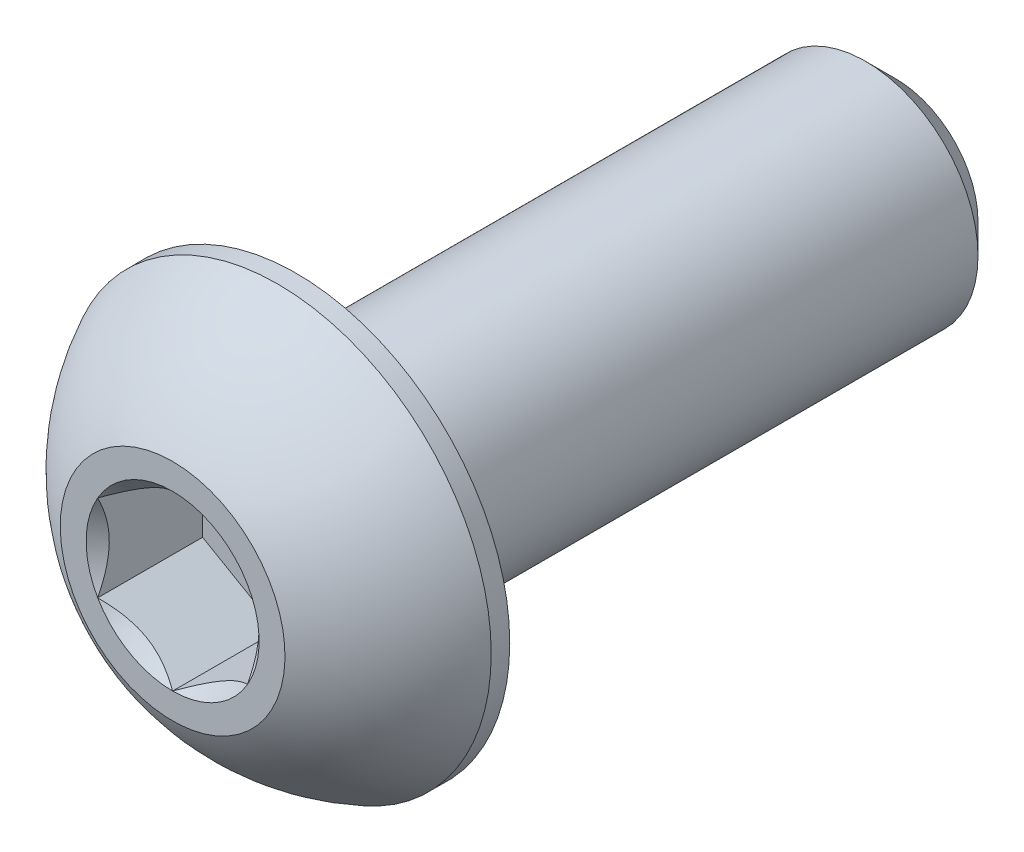
ISO-10303-21;
HEADER;
FILE_DESCRIPTION(('STEP AP214'),'2;1');
FILE_NAME('part.step','',(''),(''),'','','');
FILE_SCHEMA(('AUTOMOTIVE_DESIGN { 1 0 10303 214 1 1 1 1 }'));
ENDSEC;
DATA;
#1=APPLICATION_CONTEXT('core data for automotive mechanical design processes');
#2=APPLICATION_PROTOCOL_DEFINITION('international standard','automotive_design',2000,#1);
#3=PRODUCT_CONTEXT('',#1,'mechanical');
#4=PRODUCT('Part','Part','',(#3));
#5=PRODUCT_RELATED_PRODUCT_CATEGORY('part','',(#4));
#6=PRODUCT_DEFINITION_FORMATION('','',#4);
#7=PRODUCT_DEFINITION_CONTEXT('part definition',#1,'design');
#8=PRODUCT_DEFINITION('design','',#6,#7);
#9=PRODUCT_DEFINITION_SHAPE('','',#8);
#10=(LENGTH_UNIT() NAMED_UNIT(*) SI_UNIT(.MILLI.,.METRE.));
#11=(NAMED_UNIT(*) PLANE_ANGLE_UNIT() SI_UNIT($,.RADIAN.));
#12=(NAMED_UNIT(*) SI_UNIT($,.STERADIAN.) SOLID_ANGLE_UNIT());
#13=UNCERTAINTY_MEASURE_WITH_UNIT(LENGTH_MEASURE(1.E-05),#10,'distance_accuracy_value','');
#14=(GEOMETRIC_REPRESENTATION_CONTEXT(3) GLOBAL_UNCERTAINTY_ASSIGNED_CONTEXT((#13)) GLOBAL_UNIT_ASSIGNED_CONTEXT((#10,
#11,#12)) REPRESENTATION_CONTEXT('',''));
#15=CARTESIAN_POINT('',(0.,0.,0.));
#16=DIRECTION('',(0.,0.,1.));
#17=DIRECTION('',(1.,0.,0.));
#18=AXIS2_PLACEMENT_3D('',#15,#16,#17);
#19=CARTESIAN_POINT('',(0.,0.,4.825));
#20=DIRECTION('',(0.,0.,-1.));
#21=DIRECTION('',(-1.,0.,0.));
#22=AXIS2_PLACEMENT_3D('',#19,#20,#21);
#23=PLANE('',#22);
#24=CARTESIAN_POINT('',(0.,0.,4.825));
#25=DIRECTION('',(0.,0.,1.));
#26=DIRECTION('',(1.,0.,0.));
#27=AXIS2_PLACEMENT_3D('',#24,#25,#26);
#28=CIRCLE('',#27,1.15470053837925);
#29=CARTESIAN_POINT('',(-1.,0.577350269189626,4.825));
#30=VERTEX_POINT('',#29);
#31=CARTESIAN_POINT('',(-1.,-0.577350269189626,4.825));
#32=VERTEX_POINT('',#31);
#33=EDGE_CURVE('E132',#30,#32,#28,.T.);
#34=ORIENTED_EDGE('',*,*,#33,.F.);
#35=CARTESIAN_POINT('',(0.,1.15470053837925,4.825));
#36=VERTEX_POINT('',#35);
#37=EDGE_CURVE('E104',#36,#30,#28,.T.);
#38=ORIENTED_EDGE('',*,*,#37,.F.);
#39=CARTESIAN_POINT('',(1.,0.577350269189626,4.825));
#40=VERTEX_POINT('',#39);
#41=EDGE_CURVE('E95',#40,#36,#28,.T.);
#42=ORIENTED_EDGE('',*,*,#41,.F.);
#43=CARTESIAN_POINT('',(1.,-0.577350269189626,4.825));
#44=VERTEX_POINT('',#43);
#45=EDGE_CURVE('E56',#44,#40,#28,.T.);
#46=ORIENTED_EDGE('',*,*,#45,.F.);
#47=CARTESIAN_POINT('',(0.,-1.15470053837925,4.825));
#48=VERTEX_POINT('',#47);
#49=EDGE_CURVE('E63',#48,#44,#28,.T.);
#50=ORIENTED_EDGE('',*,*,#49,.F.);
#51=EDGE_CURVE('E133',#32,#48,#28,.T.);
#52=ORIENTED_EDGE('',*,*,#51,.F.);
#53=EDGE_LOOP('',(#34,#38,#42,#46,#50,#52));
#54=FACE_BOUND('',#53,.T.);
#55=CARTESIAN_POINT('',(0.,0.,4.825));
#56=DIRECTION('',(0.,0.,1.));
#57=DIRECTION('',(1.,0.,0.));
#58=AXIS2_PLACEMENT_3D('',#55,#56,#57);
#59=CIRCLE('',#58,1.5);
#60=CARTESIAN_POINT('',(0.,1.5,4.825));
#61=VERTEX_POINT('',#60);
#62=EDGE_CURVE('E50',#61,#61,#59,.T.);
#63=ORIENTED_EDGE('',*,*,#62,.T.);
#64=EDGE_LOOP('',(#63));
#65=FACE_BOUND('',#64,.T.);
#66=ADVANCED_FACE('F37',(#54,#65),#23,.F.);
#67=CARTESIAN_POINT('',(0.,0.,2.03016711229946));
#68=DIRECTION('',(0.,0.,1.));
#69=DIRECTION('',(0.,1.,0.));
#70=AXIS2_PLACEMENT_3D('',#67,#68,#69);
#71=SPHERICAL_SURFACE('',#70,3.17192226735973);
#72=CARTESIAN_POINT('',(0.,0.,3.4225));
#73=DIRECTION('',(0.,0.,1.));
#74=DIRECTION('',(1.,0.,0.));
#75=AXIS2_PLACEMENT_3D('',#72,#73,#74);
#76=CIRCLE('',#75,2.85);
#77=CARTESIAN_POINT('',(0.,2.85,3.4225));
#78=VERTEX_POINT('',#77);
#79=EDGE_CURVE('E215',#78,#78,#76,.T.);
#80=CARTESIAN_POINT('',(0.,1.5,4.825));
#81=CARTESIAN_POINT('',(0.,1.5181600798921,4.81525343052663));
#82=CARTESIAN_POINT('',(0.,1.53622513742981,4.80532981527615));
#83=CARTESIAN_POINT('',(0.,1.57215840256594,4.78513236887069));
#84=CARTESIAN_POINT('',(0.,1.59002661016438,4.7748585377157));
#85=CARTESIAN_POINT('',(0.,1.6255593701915,4.75396453515097));
#86=CARTESIAN_POINT('',(0.,1.64322392262019,4.74334436374123));
#87=CARTESIAN_POINT('',(0.,1.67834266450262,4.72176172357303));
#88=CARTESIAN_POINT('',(0.,1.69579685395635,4.71079925481458));
#89=CARTESIAN_POINT('',(0.,1.73048823664554,4.68853618336439));
#90=CARTESIAN_POINT('',(0.,1.74772542988099,4.67723558067265));
#91=CARTESIAN_POINT('',(0.,1.78197627078176,4.65430053581285));
#92=CARTESIAN_POINT('',(0.,1.79898991844709,4.64266609364478));
#93=CARTESIAN_POINT('',(0.,1.83278720341135,4.61906779045309));
#94=CARTESIAN_POINT('',(0.,1.84957084071028,4.60710392942946));
#95=CARTESIAN_POINT('',(0.,1.88290172764636,4.58285133450125));
#96=CARTESIAN_POINT('',(0.,1.8994489772835,4.57056260059666));
#97=CARTESIAN_POINT('',(0.,1.93230080139369,4.54566492927458));
#98=CARTESIAN_POINT('',(0.,1.94860537586673,4.53305599185708));
#99=CARTESIAN_POINT('',(0.,1.98096565436365,4.50752270455889));
#100=CARTESIAN_POINT('',(0.,1.99702135838753,4.49459835467819));
#101=CARTESIAN_POINT('',(0.,2.02887779526296,4.46843915334777));
#102=CARTESIAN_POINT('',(0.,2.04467852811452,4.45520430189805));
#103=CARTESIAN_POINT('',(0.,2.07601901880464,4.42842912630669));
#104=CARTESIAN_POINT('',(0.,2.09155877664321,4.41488880216506));
#105=CARTESIAN_POINT('',(0.,2.12237141262985,4.38750782613789));
#106=CARTESIAN_POINT('',(0.,2.13764429077792,4.37366717425237));
#107=CARTESIAN_POINT('',(0.,2.16791736411296,4.34569080180173));
#108=CARTESIAN_POINT('',(0.,2.18291755929993,4.33155508123663));
#109=CARTESIAN_POINT('',(0.,2.21263956705415,4.30299394260905));
#110=CARTESIAN_POINT('',(0.,2.22736137962139,4.28856852454658));
#111=CARTESIAN_POINT('',(0.,2.2565210282552,4.25943347218353));
#112=CARTESIAN_POINT('',(0.,2.27095886432177,4.24472383788295));
#113=CARTESIAN_POINT('',(0.,2.2995450739765,4.21502594229721));
#114=CARTESIAN_POINT('',(0.,2.31369344756465,4.20003768101205));
#115=CARTESIAN_POINT('',(0.,2.34169535627252,4.16978822658124));
#116=CARTESIAN_POINT('',(0.,2.35554889139223,4.15452703343559));
#117=CARTESIAN_POINT('',(0.,2.38295585920366,4.12373751411442));
#118=CARTESIAN_POINT('',(0.,2.39650929189537,4.1082091879389));
#119=CARTESIAN_POINT('',(0.,2.42331090492182,4.07689130289176));
#120=CARTESIAN_POINT('',(0.,2.43655908525656,4.06110174402014));
#121=CARTESIAN_POINT('',(0.,2.46274515962755,4.02926739317577));
#122=CARTESIAN_POINT('',(0.,2.47568305366379,4.01322260120302));
#123=CARTESIAN_POINT('',(0.,2.5012436393965,3.98088388073288));
#124=CARTESIAN_POINT('',(0.,2.51386633109298,3.96458995223548));
#125=CARTESIAN_POINT('',(0.,2.53879171587278,3.9317591499574));
#126=CARTESIAN_POINT('',(0.,2.55109440895612,3.91522227617671));
#127=CARTESIAN_POINT('',(0.,2.57537512182785,3.88191186688636));
#128=CARTESIAN_POINT('',(0.,2.58735314161625,3.8651383313767));
#129=CARTESIAN_POINT('',(0.,2.61097995657956,3.83136097210575));
#130=CARTESIAN_POINT('',(0.,2.62262875175448,3.81435714834448));
#131=CARTESIAN_POINT('',(0.,2.64559269128198,3.78012567355775));
#132=CARTESIAN_POINT('',(0.,2.65690783563458,3.76289802253229));
#133=CARTESIAN_POINT('',(0.,2.67920017403639,3.72822543922701));
#134=CARTESIAN_POINT('',(0.,2.69017736808561,3.71078050694718));
#135=CARTESIAN_POINT('',(0.,2.711789634999,3.67567998980005));
#136=CARTESIAN_POINT('',(0.,2.72242470786316,3.65802440493275));
#137=CARTESIAN_POINT('',(0.,2.74334869082117,3.62250929096058));
#138=CARTESIAN_POINT('',(0.,2.75363760091502,3.60464976185571));
#139=CARTESIAN_POINT('',(0.,2.77386535089241,3.56873354659176));
#140=CARTESIAN_POINT('',(0.,2.78380419077596,3.55067686043268));
#141=CARTESIAN_POINT('',(0.,2.80332801615778,3.51437318815589));
#142=CARTESIAN_POINT('',(0.,2.81291300165605,3.49612620203818));
#143=CARTESIAN_POINT('',(0.,2.83172550494215,3.45944887791611));
#144=CARTESIAN_POINT('',(0.,2.84095302272998,3.44101853991173));
#145=CARTESIAN_POINT('',(0.,2.85,3.4225));
#146=B_SPLINE_CURVE_WITH_KNOTS('',3,(#80,#81,#82,#83,#84,#85,#86,#87,#88,#89,#90,#91,#92,#93,
#94,#95,#96,#97,#98,#99,#100,#101,#102,#103,#104,#105,#106,#107,#108,#109,#110,#111,#112,#113,
#114,#115,#116,#117,#118,#119,#120,#121,#122,#123,#124,#125,#126,#127,#128,#129,#130,#131,#132,
#133,#134,#135,#136,#137,#138,#139,#140,#141,#142,#143,#144,#145),.UNSPECIFIED.,.F.,.F.,(4,2,2,
2,2,2,2,2,2,2,2,2,2,2,2,2,2,2,2,2,2,2,2,2,2,2,2,2,2,2,2,2,4),(0.,0.0618298941826983,
0.123659788365397,0.185489682548095,0.247319576730793,0.309149470913491,0.370979365096189,
0.432809259278887,0.494639153461586,0.556469047644284,0.618298941826982,0.680128836009681,
0.741958730192379,0.803788624375077,0.865618518557774,0.927448412740473,0.989278306923171,
1.05110820110587,1.11293809528857,1.17476798947127,1.23659788365396,1.29842777783666,
1.36025767201936,1.42208756620206,1.48391746038476,1.54574735456745,1.60757724875015,
1.66940714293285,1.73123703711555,1.79306693129825,1.85489682548095,1.91672671966364,
1.97855661384634),.UNSPECIFIED.);
#147=EDGE_CURVE('BSEAM220',#61,#78,#146,.T.);
#148=ORIENTED_EDGE('',*,*,#62,.F.);
#149=ORIENTED_EDGE('',*,*,#79,.T.);
#150=ORIENTED_EDGE('',*,*,#147,.T.);
#151=ORIENTED_EDGE('',*,*,#147,.F.);
#152=EDGE_LOOP('',(#148,#150,#149,#151));
#153=FACE_BOUND('',#152,.T.);
#154=ADVANCED_FACE('F220',(#153),#71,.T.);
#155=CARTESIAN_POINT('',(0.,0.,4.825));
#156=DIRECTION('',(0.,0.,1.));
#157=DIRECTION('',(1.,0.,0.));
#158=AXIS2_PLACEMENT_3D('',#155,#156,#157);
#159=CYLINDRICAL_SURFACE('',#158,2.85);
#160=ORIENTED_EDGE('',*,*,#79,.F.);
#161=EDGE_LOOP('',(#160));
#162=FACE_BOUND('',#161,.T.);
#163=CARTESIAN_POINT('',(0.,0.,3.175));
#164=DIRECTION('',(0.,0.,1.));
#165=DIRECTION('',(1.,0.,0.));
#166=AXIS2_PLACEMENT_3D('',#163,#164,#165);
#167=CIRCLE('',#166,2.85);
#168=CARTESIAN_POINT('',(2.85,0.,3.175));
#169=VERTEX_POINT('',#168);
#170=EDGE_CURVE('E212',#169,#169,#167,.T.);
#171=ORIENTED_EDGE('',*,*,#170,.T.);
#172=EDGE_LOOP('',(#171));
#173=FACE_BOUND('',#172,.T.);
#174=ADVANCED_FACE('F223',(#162,#173),#159,.T.);
#175=CARTESIAN_POINT('',(0.,1.5,3.175));
#176=DIRECTION('',(0.,0.,1.));
#177=DIRECTION('',(1.,0.,0.));
#178=AXIS2_PLACEMENT_3D('',#175,#176,#177);
#179=PLANE('',#178);
#180=ORIENTED_EDGE('',*,*,#170,.F.);
#181=EDGE_LOOP('',(#180));
#182=FACE_BOUND('',#181,.T.);
#183=CARTESIAN_POINT('',(0.,0.,3.175));
#184=DIRECTION('',(0.,0.,1.));
#185=DIRECTION('',(1.,0.,0.));
#186=AXIS2_PLACEMENT_3D('',#183,#184,#185);
#187=CIRCLE('',#186,1.5);
#188=CARTESIAN_POINT('',(1.5,0.,3.175));
#189=VERTEX_POINT('',#188);
#190=EDGE_CURVE('E209',#189,#189,#187,.T.);
#191=ORIENTED_EDGE('',*,*,#190,.T.);
#192=EDGE_LOOP('',(#191));
#193=FACE_BOUND('',#192,.T.);
#194=ADVANCED_FACE('F228',(#182,#193),#179,.F.);
#195=CARTESIAN_POINT('',(0.,0.,4.825));
#196=DIRECTION('',(0.,0.,1.));
#197=DIRECTION('',(1.,0.,0.));
#198=AXIS2_PLACEMENT_3D('',#195,#196,#197);
#199=CYLINDRICAL_SURFACE('',#198,1.5);
#200=ORIENTED_EDGE('',*,*,#190,.F.);
#201=EDGE_LOOP('',(#200));
#202=FACE_BOUND('',#201,.T.);
#203=CARTESIAN_POINT('',(0.,0.,-4.425));
#204=DIRECTION('',(0.,0.,1.));
#205=DIRECTION('',(1.,0.,0.));
#206=AXIS2_PLACEMENT_3D('',#203,#204,#205);
#207=CIRCLE('',#206,1.5);
#208=CARTESIAN_POINT('',(1.5,0.,-4.425));
#209=VERTEX_POINT('',#208);
#210=EDGE_CURVE('E206',#209,#209,#207,.T.);
#211=ORIENTED_EDGE('',*,*,#210,.T.);
#212=EDGE_LOOP('',(#211));
#213=FACE_BOUND('',#212,.T.);
#214=ADVANCED_FACE('F234',(#202,#213),#199,.T.);
#215=CARTESIAN_POINT('',(0.,0.,-4.825));
#216=DIRECTION('',(0.,0.,1.));
#217=DIRECTION('',(1.,0.,0.));
#218=AXIS2_PLACEMENT_3D('',#215,#216,#217);
#219=CONICAL_SURFACE('',#218,1.1,0.785398163397444);
#220=ORIENTED_EDGE('',*,*,#210,.F.);
#221=EDGE_LOOP('',(#220));
#222=FACE_BOUND('',#221,.T.);
#223=CARTESIAN_POINT('',(0.,0.,-4.825));
#224=DIRECTION('',(0.,0.,1.));
#225=DIRECTION('',(1.,0.,0.));
#226=AXIS2_PLACEMENT_3D('',#223,#224,#225);
#227=CIRCLE('',#226,1.1);
#228=CARTESIAN_POINT('',(1.1,0.,-4.825));
#229=VERTEX_POINT('',#228);
#230=EDGE_CURVE('E193',#229,#229,#227,.T.);
#231=ORIENTED_EDGE('',*,*,#230,.T.);
#232=EDGE_LOOP('',(#231));
#233=FACE_BOUND('',#232,.T.);
#234=ADVANCED_FACE('F240',(#222,#233),#219,.T.);
#235=CARTESIAN_POINT('',(0.,0.,-4.825));
#236=DIRECTION('',(0.,0.,1.));
#237=DIRECTION('',(1.,0.,0.));
#238=AXIS2_PLACEMENT_3D('',#235,#236,#237);
#239=PLANE('',#238);
#240=ORIENTED_EDGE('',*,*,#230,.F.);
#241=EDGE_LOOP('',(#240));
#242=FACE_BOUND('',#241,.T.);
#243=ADVANCED_FACE('F166',(#242),#239,.F.);
#244=CARTESIAN_POINT('',(0.,0.,4.825));
#245=DIRECTION('',(0.,0.,1.));
#246=DIRECTION('',(1.,0.,0.));
#247=AXIS2_PLACEMENT_3D('',#244,#245,#246);
#248=CONICAL_SURFACE('',#247,1.15470053837925,0.78539816339745);
#249=ORIENTED_EDGE('',*,*,#37,.T.);
#250=CARTESIAN_POINT('',(0.000200000000000198,1.15481600843309,4.82511548737261));
#251=CARTESIAN_POINT('',(-0.0341825950071806,1.13496520795026,4.80527793082573));
#252=CARTESIAN_POINT('',(-0.0691401181398248,1.11478247255942,4.78660502063889));
#253=CARTESIAN_POINT('',(-0.14042280295609,1.07362739529219,4.75241474272316));
#254=CARTESIAN_POINT('',(-0.176754750528984,1.0526511355808,4.73691640902346));
#255=CARTESIAN_POINT('',(-0.250016613803311,1.01035337909803,4.71036730714227));
#256=CARTESIAN_POINT('',(-0.286927851445414,0.989042666109241,4.69924977399693));
#257=CARTESIAN_POINT('',(-0.361562729310859,0.945952199282692,4.68211986577618));
#258=CARTESIAN_POINT('',(-0.399284088108636,0.924173762626597,4.67609469746667));
#259=CARTESIAN_POINT('',(-0.464292198417934,0.886641312640015,4.67066055496749));
#260=CARTESIAN_POINT('',(-0.491494371528172,0.870936130672276,4.66985693831673));
#261=CARTESIAN_POINT('',(-0.545846040669112,0.839556179862849,4.67120669941689));
#262=CARTESIAN_POINT('',(-0.572995523754876,0.823881418494924,4.6733607295472));
#263=CARTESIAN_POINT('',(-0.65405627732696,0.777080970599367,4.68411697212847));
#264=CARTESIAN_POINT('',(-0.707564140978428,0.746188191116431,4.69701455641536));
#265=CARTESIAN_POINT('',(-0.801476065143432,0.69196811641965,4.72814073060218));
#266=CARTESIAN_POINT('',(-0.842320523671834,0.668386557293372,4.74473779770184));
#267=CARTESIAN_POINT('',(-0.922409637381943,0.622147085933682,4.78212492468529));
#268=CARTESIAN_POINT('',(-0.961659010870437,0.599486449584576,4.8029013418174));
#269=CARTESIAN_POINT('',(-1.0002,0.577234799135789,4.82511548737261));
#270=B_SPLINE_CURVE_WITH_KNOTS('',3,(#250,#251,#252,#253,#254,#255,#256,#257,#258,#259,#260,
#261,#262,#263,#264,#265,#266,#267,#268,#269),.UNSPECIFIED.,.F.,.F.,(4,2,2,2,2,2,2,2,2,4),(0.,
0.133237676828559,0.267252229834491,0.399137076269301,0.530689603280769,0.624814864263847,
0.718960890149133,0.907306626112098,1.05710100361789,1.20641411519286),.UNSPECIFIED.);
#271=EDGE_CURVE('E11',#36,#30,#270,.T.);
#272=ORIENTED_EDGE('',*,*,#271,.F.);
#273=EDGE_LOOP('',(#249,#272));
#274=FACE_BOUND('',#273,.T.);
#275=ADVANCED_FACE('F108',(#274),#248,.F.);
#276=ORIENTED_EDGE('',*,*,#33,.T.);
#277=CARTESIAN_POINT('',(-1.,-1.15147208646462,5.19538567751386));
#278=CARTESIAN_POINT('',(-1.,-1.12343447988552,5.17421991987371));
#279=CARTESIAN_POINT('',(-1.,-1.09524064850697,5.15326169217591));
#280=CARTESIAN_POINT('',(-1.,-1.03847715644376,5.11184602223562));
#281=CARTESIAN_POINT('',(-1.,-1.00990740382975,5.09138870612366));
#282=CARTESIAN_POINT('',(-1.,-0.923120894333476,5.03060479495451));
#283=CARTESIAN_POINT('',(-1.,-0.864253173759058,4.9911922289614));
#284=CARTESIAN_POINT('',(-1.,-0.740809858258044,4.9138206642002));
#285=CARTESIAN_POINT('',(-1.,-0.676100255137806,4.87607303911434));
#286=CARTESIAN_POINT('',(-1.,-0.543448939049124,4.80702458755129));
#287=CARTESIAN_POINT('',(-1.,-0.475519112027778,4.77570202784686));
#288=CARTESIAN_POINT('',(-1.,-0.373555850333528,4.73738177888379));
#289=CARTESIAN_POINT('',(-1.,-0.341031989670907,4.72638359164216));
#290=CARTESIAN_POINT('',(-1.,-0.275199079052293,4.70699834214736));
#291=CARTESIAN_POINT('',(-1.,-0.241889975173932,4.6986114597767));
#292=CARTESIAN_POINT('',(-1.,-0.175247517042992,4.68502522071902));
#293=CARTESIAN_POINT('',(-1.,-0.141925568218174,4.67977079076797));
#294=CARTESIAN_POINT('',(-1.,-0.0749144362322786,4.67254868657089));
#295=CARTESIAN_POINT('',(-1.,-0.0412251978501614,4.67058151361051));
#296=CARTESIAN_POINT('',(-1.,0.0249580992634213,4.67008319839316));
#297=CARTESIAN_POINT('',(-1.,0.0574512826460395,4.67143026788863));
#298=CARTESIAN_POINT('',(-1.,0.122148505701867,4.67721648449898));
#299=CARTESIAN_POINT('',(-1.,0.154352610132926,4.68165492066153));
#300=CARTESIAN_POINT('',(-1.,0.21879989886764,4.6934568301452));
#301=CARTESIAN_POINT('',(-1.,0.251033743268954,4.70087054103851));
#302=CARTESIAN_POINT('',(-1.,0.314797132354919,4.71822894249867));
#303=CARTESIAN_POINT('',(-1.,0.346326735731005,4.72817342128883));
#304=CARTESIAN_POINT('',(-1.,0.445594187730205,4.76322348255434));
#305=CARTESIAN_POINT('',(-1.,0.511919139476037,4.79232085835672));
#306=CARTESIAN_POINT('',(-1.,0.641453244657533,4.8570153296865));
#307=CARTESIAN_POINT('',(-1.,0.704650133126345,4.89263577671524));
#308=CARTESIAN_POINT('',(-1.,0.825428490174988,4.96612390134693));
#309=CARTESIAN_POINT('',(-1.,0.883132947867686,5.00379194713546));
#310=CARTESIAN_POINT('',(-1.,0.968148853704567,5.06202285294316));
#311=CARTESIAN_POINT('',(-1.,0.996120570380286,5.08163847576286));
#312=CARTESIAN_POINT('',(-1.,1.05168177729902,5.12138851706127));
#313=CARTESIAN_POINT('',(-1.,1.079271369977,5.14152279219883));
#314=CARTESIAN_POINT('',(-1.,1.10670185346329,5.16187211907297));
#315=B_SPLINE_CURVE_WITH_KNOTS('',3,(#277,#278,#279,#280,#281,#282,#283,#284,#285,#286,#287,
#288,#289,#290,#291,#292,#293,#294,#295,#296,#297,#298,#299,#300,#301,#302,#303,#304,#305,#306,
#307,#308,#309,#310,#311,#312,#313,#314),.UNSPECIFIED.,.F.,.F.,(4,2,2,2,2,2,2,2,2,2,2,2,2,2,2,2,
2,2,4),(0.,0.10538645908329,0.210799187330125,0.423233611565469,0.647793540908503,
0.871580877738609,0.97449307418142,1.07741235827201,1.17846428203205,1.27953161415762,
1.3769408673961,1.47432772585408,1.57343322804293,1.67253043972851,1.88917353996827,
2.10660791038813,2.31323734249843,2.41572589232045,2.51818641476503),.UNSPECIFIED.);
#316=EDGE_CURVE('E103',#30,#32,#315,.F.);
#317=ORIENTED_EDGE('',*,*,#316,.F.);
#318=EDGE_LOOP('',(#276,#317));
#319=FACE_BOUND('',#318,.T.);
#320=ADVANCED_FACE('F253',(#319),#248,.F.);
#321=ORIENTED_EDGE('',*,*,#51,.T.);
#322=CARTESIAN_POINT('',(-1.0002,-0.577234799135788,4.82511548737261));
#323=CARTESIAN_POINT('',(-0.965817404992819,-0.597085599618621,4.80527793082573));
#324=CARTESIAN_POINT('',(-0.930859881860175,-0.617268335009456,4.78660502063889));
#325=CARTESIAN_POINT('',(-0.85957719704391,-0.658423412276686,4.75241474272316));
#326=CARTESIAN_POINT('',(-0.823245249471016,-0.67939967198808,4.73691640902346));
#327=CARTESIAN_POINT('',(-0.749983386196689,-0.721697428470846,4.71036730714227));
#328=CARTESIAN_POINT('',(-0.713072148554586,-0.743008141459636,4.69924977399692));
#329=CARTESIAN_POINT('',(-0.638437270689141,-0.786098608286186,4.68211986577618));
#330=CARTESIAN_POINT('',(-0.600715911891364,-0.807877044942281,4.67609469746667));
#331=CARTESIAN_POINT('',(-0.535707801582066,-0.845409494928863,4.67066055496749));
#332=CARTESIAN_POINT('',(-0.508505628471828,-0.861114676896602,4.66985693831673));
#333=CARTESIAN_POINT('',(-0.454153959330888,-0.892494627706029,4.67120669941689));
#334=CARTESIAN_POINT('',(-0.427004476245124,-0.908169389073954,4.6733607295472));
#335=CARTESIAN_POINT('',(-0.34594372267304,-0.954969836969511,4.68411697212847));
#336=CARTESIAN_POINT('',(-0.292435859021573,-0.985862616452447,4.69701455641535));
#337=CARTESIAN_POINT('',(-0.198523934856568,-1.04008269114923,4.72814073060218));
#338=CARTESIAN_POINT('',(-0.157679476328166,-1.06366425027551,4.74473779770184));
#339=CARTESIAN_POINT('',(-0.0775903626180561,-1.1099037216352,4.78212492468529));
#340=CARTESIAN_POINT('',(-0.0383409891295621,-1.1325643579843,4.8029013418174));
#341=CARTESIAN_POINT('',(0.000200000000000036,-1.15481600843309,4.82511548737261));
#342=B_SPLINE_CURVE_WITH_KNOTS('',3,(#322,#323,#324,#325,#326,#327,#328,#329,#330,#331,#332,
#333,#334,#335,#336,#337,#338,#339,#340,#341),.UNSPECIFIED.,.F.,.F.,(4,2,2,2,2,2,2,2,2,4),(0.,
0.133237676828559,0.26725222983449,0.3991370762693,0.530689603280768,0.624814864263846,
0.718960890149133,0.907306626112098,1.05710100361789,1.20641411519286),.UNSPECIFIED.);
#343=EDGE_CURVE('E142',#32,#48,#342,.T.);
#344=ORIENTED_EDGE('',*,*,#343,.F.);
#345=EDGE_LOOP('',(#321,#344));
#346=FACE_BOUND('',#345,.T.);
#347=ADVANCED_FACE('F270',(#346),#248,.F.);
#348=ORIENTED_EDGE('',*,*,#49,.T.);
#349=CARTESIAN_POINT('',(-0.000200000000000295,-1.15481600843309,4.82511548737261));
#350=CARTESIAN_POINT('',(0.0341825950071805,-1.13496520795026,4.80527793082573));
#351=CARTESIAN_POINT('',(0.0691401181398247,-1.11478247255942,4.78660502063889));
#352=CARTESIAN_POINT('',(0.140422802956089,-1.07362739529219,4.75241474272316));
#353=CARTESIAN_POINT('',(0.176754750528984,-1.0526511355808,4.73691640902346));
#354=CARTESIAN_POINT('',(0.250016613803311,-1.01035337909803,4.71036730714226));
#355=CARTESIAN_POINT('',(0.286927851445414,-0.98904266610924,4.69924977399692));
#356=CARTESIAN_POINT('',(0.361562729310859,-0.945952199282691,4.68211986577618));
#357=CARTESIAN_POINT('',(0.399284088108635,-0.924173762626596,4.67609469746667));
#358=CARTESIAN_POINT('',(0.464292198417933,-0.886641312640014,4.67066055496749));
#359=CARTESIAN_POINT('',(0.491494371528171,-0.870936130672275,4.66985693831673));
#360=CARTESIAN_POINT('',(0.545846040669111,-0.839556179862848,4.67120669941689));
#361=CARTESIAN_POINT('',(0.572995523754875,-0.823881418494923,4.6733607295472));
#362=CARTESIAN_POINT('',(0.65405627732696,-0.777080970599367,4.68411697212847));
#363=CARTESIAN_POINT('',(0.707564140978427,-0.74618819111643,4.69701455641535));
#364=CARTESIAN_POINT('',(0.801476065143431,-0.691968116419649,4.72814073060218));
#365=CARTESIAN_POINT('',(0.842320523671834,-0.668386557293371,4.74473779770184));
#366=CARTESIAN_POINT('',(0.922409637381943,-0.622147085933681,4.78212492468529));
#367=CARTESIAN_POINT('',(0.961659010870437,-0.599486449584575,4.8029013418174));
#368=CARTESIAN_POINT('',(1.0002,-0.577234799135788,4.82511548737261));
#369=B_SPLINE_CURVE_WITH_KNOTS('',3,(#349,#350,#351,#352,#353,#354,#355,#356,#357,#358,#359,
#360,#361,#362,#363,#364,#365,#366,#367,#368),.UNSPECIFIED.,.F.,.F.,(4,2,2,2,2,2,2,2,2,4),(0.,
0.133237676828559,0.267252229834491,0.3991370762693,0.530689603280768,0.624814864263846,
0.718960890149133,0.907306626112097,1.05710100361789,1.20641411519286),.UNSPECIFIED.);
#370=EDGE_CURVE('E350',#48,#44,#369,.T.);
#371=ORIENTED_EDGE('',*,*,#370,.F.);
#372=EDGE_LOOP('',(#348,#371));
#373=FACE_BOUND('',#372,.T.);
#374=ADVANCED_FACE('F277',(#373),#248,.F.);
#375=ORIENTED_EDGE('',*,*,#45,.T.);
#376=CARTESIAN_POINT('',(1.,-1.15147208663215,5.19538567764035));
#377=CARTESIAN_POINT('',(1.,-1.12343448004835,5.17421991999533));
#378=CARTESIAN_POINT('',(1.,-1.09524064866509,5.15326169229266));
#379=CARTESIAN_POINT('',(1.,-1.0384771565924,5.11184602234267));
#380=CARTESIAN_POINT('',(1.,-1.00990740397363,5.09138870622588));
#381=CARTESIAN_POINT('',(1.,-0.923120894462775,5.03060479504213));
#382=CARTESIAN_POINT('',(1.,-0.864253173878444,4.99119222903932));
#383=CARTESIAN_POINT('',(1.,-0.74080985835581,4.91382066425819));
#384=CARTESIAN_POINT('',(1.,-0.676100255223808,4.87607303916216));
#385=CARTESIAN_POINT('',(1.,-0.543448939110597,4.80702458758025));
#386=CARTESIAN_POINT('',(1.,-0.475519112076495,4.77570202786713));
#387=CARTESIAN_POINT('',(1.,-0.373555850372647,4.7373817788976));
#388=CARTESIAN_POINT('',(1.,-0.341031989714045,4.72638359165621));
#389=CARTESIAN_POINT('',(1.,-0.275199079103601,4.70699834216111));
#390=CARTESIAN_POINT('',(1.,-0.241889975229392,4.69861145978989));
#391=CARTESIAN_POINT('',(1.,-0.175247517106615,4.68502522073014));
#392=CARTESIAN_POINT('',(1.,-0.141925568285808,4.67977079077761));
#393=CARTESIAN_POINT('',(1.,-0.0749144363078012,4.67254868657667));
#394=CARTESIAN_POINT('',(1.,-0.041225197929563,4.6705815136139));
#395=CARTESIAN_POINT('',(1.,0.024958099176864,4.67008319839111));
#396=CARTESIAN_POINT('',(1.,0.0574512825561955,4.67143026788357));
#397=CARTESIAN_POINT('',(1.,0.122148505605778,4.67721648448742));
#398=CARTESIAN_POINT('',(1.,0.15435261003388,4.68165492064648));
#399=CARTESIAN_POINT('',(1.,0.218799898762754,4.69345683012285));
#400=CARTESIAN_POINT('',(1.,0.251033743161195,4.70087054101231));
#401=CARTESIAN_POINT('',(1.,0.314797132241693,4.71822894246471));
#402=CARTESIAN_POINT('',(1.,0.346326735615183,4.72817342125094));
#403=CARTESIAN_POINT('',(1.,0.445594187589164,4.76322348249794));
#404=CARTESIAN_POINT('',(1.,0.511919139313635,4.7923208582833));
#405=CARTESIAN_POINT('',(1.,0.641453244454049,4.85701532957714));
#406=CARTESIAN_POINT('',(1.,0.704650132903151,4.89263577658696));
#407=CARTESIAN_POINT('',(1.,0.825428489916356,4.96612390118245));
#408=CARTESIAN_POINT('',(1.,0.883132947593201,5.00379194695385));
#409=CARTESIAN_POINT('',(1.,0.968148853406641,5.06202285273595));
#410=CARTESIAN_POINT('',(1.,0.99612057007466,5.08163847554718));
#411=CARTESIAN_POINT('',(1.,1.05168177697804,5.12138851682867));
#412=CARTESIAN_POINT('',(1.,1.07927136964838,5.14152279195778));
#413=CARTESIAN_POINT('',(1.,1.10670185312703,5.16187211882347));
#414=B_SPLINE_CURVE_WITH_KNOTS('',3,(#376,#377,#378,#379,#380,#381,#382,#383,#384,#385,#386,
#387,#388,#389,#390,#391,#392,#393,#394,#395,#396,#397,#398,#399,#400,#401,#402,#403,#404,#405,
#406,#407,#408,#409,#410,#411,#412,#413),.UNSPECIFIED.,.F.,.F.,(4,2,2,2,2,2,2,2,2,2,2,2,2,2,2,2,
2,2,4),(0.,0.10538645910335,0.210799187370248,0.423233611646473,0.647793541035351,
0.871580877910865,0.974493074342054,1.07741235842104,1.17846428216995,1.27953161428439,
1.37694086751269,1.47432772596047,1.57343322813835,1.67253043981296,1.88917353997386,
2.10660791031433,2.31323734235672,2.41572589214523,2.51818641455632),.UNSPECIFIED.);
#415=EDGE_CURVE('E120',#44,#40,#414,.T.);
#416=ORIENTED_EDGE('',*,*,#415,.F.);
#417=EDGE_LOOP('',(#375,#416));
#418=FACE_BOUND('',#417,.T.);
#419=ADVANCED_FACE('F284',(#418),#248,.F.);
#420=ORIENTED_EDGE('',*,*,#41,.T.);
#421=CARTESIAN_POINT('',(1.0002,0.577234799135789,4.82511548737261));
#422=CARTESIAN_POINT('',(0.965817404992819,0.597085599618622,4.80527793082573));
#423=CARTESIAN_POINT('',(0.930859881860175,0.617268335009457,4.78660502063889));
#424=CARTESIAN_POINT('',(0.85957719704391,0.658423412276687,4.75241474272316));
#425=CARTESIAN_POINT('',(0.823245249471016,0.67939967198808,4.73691640902346));
#426=CARTESIAN_POINT('',(0.749983386196689,0.721697428470847,4.71036730714227));
#427=CARTESIAN_POINT('',(0.713072148554585,0.743008141459637,4.69924977399693));
#428=CARTESIAN_POINT('',(0.638437270689141,0.786098608286187,4.68211986577618));
#429=CARTESIAN_POINT('',(0.600715911891364,0.807877044942282,4.67609469746667));
#430=CARTESIAN_POINT('',(0.535707801582066,0.845409494928864,4.67066055496749));
#431=CARTESIAN_POINT('',(0.508505628471828,0.861114676896603,4.66985693831673));
#432=CARTESIAN_POINT('',(0.454153959330888,0.89249462770603,4.67120669941689));
#433=CARTESIAN_POINT('',(0.427004476245124,0.908169389073955,4.6733607295472));
#434=CARTESIAN_POINT('',(0.34594372267304,0.954969836969511,4.68411697212847));
#435=CARTESIAN_POINT('',(0.292435859021572,0.985862616452448,4.69701455641536));
#436=CARTESIAN_POINT('',(0.198523934856568,1.04008269114923,4.72814073060218));
#437=CARTESIAN_POINT('',(0.157679476328165,1.06366425027551,4.74473779770184));
#438=CARTESIAN_POINT('',(0.0775903626180562,1.1099037216352,4.78212492468529));
#439=CARTESIAN_POINT('',(0.0383409891295623,1.1325643579843,4.8029013418174));
#440=CARTESIAN_POINT('',(-0.000199999999999933,1.15481600843309,4.82511548737261));
#441=B_SPLINE_CURVE_WITH_KNOTS('',3,(#421,#422,#423,#424,#425,#426,#427,#428,#429,#430,#431,
#432,#433,#434,#435,#436,#437,#438,#439,#440),.UNSPECIFIED.,.F.,.F.,(4,2,2,2,2,2,2,2,2,4),(0.,
0.133237676828559,0.26725222983449,0.3991370762693,0.530689603280768,0.624814864263846,
0.718960890149133,0.907306626112097,1.05710100361789,1.20641411519286),.UNSPECIFIED.);
#442=EDGE_CURVE('E99',#40,#36,#441,.T.);
#443=ORIENTED_EDGE('',*,*,#442,.F.);
#444=EDGE_LOOP('',(#420,#443));
#445=FACE_BOUND('',#444,.T.);
#446=ADVANCED_FACE('F97',(#445),#248,.F.);
#447=CARTESIAN_POINT('',(0.,0.,3.425));
#448=DIRECTION('',(0.,0.,1.));
#449=DIRECTION('',(1.,0.,0.));
#450=AXIS2_PLACEMENT_3D('',#447,#448,#449);
#451=PLANE('',#450);
#452=DIRECTION('',(-0.866025403784439,0.5,0.));
#453=VECTOR('',#452,1.);
#454=CARTESIAN_POINT('',(1.,0.577350269189626,3.425));
#455=LINE('',#454,#453);
#456=CARTESIAN_POINT('',(1.,0.577350269189626,3.425));
#457=VERTEX_POINT('',#456);
#458=CARTESIAN_POINT('',(0.,1.15470053837925,3.425));
#459=VERTEX_POINT('',#458);
#460=EDGE_CURVE('E119',#457,#459,#455,.T.);
#461=ORIENTED_EDGE('',*,*,#460,.T.);
#462=DIRECTION('',(-0.866025403784439,-0.5,0.));
#463=VECTOR('',#462,1.);
#464=CARTESIAN_POINT('',(0.,1.15470053837925,3.425));
#465=LINE('',#464,#463);
#466=CARTESIAN_POINT('',(-1.,0.577350269189626,3.425));
#467=VERTEX_POINT('',#466);
#468=EDGE_CURVE('E124',#459,#467,#465,.T.);
#469=ORIENTED_EDGE('',*,*,#468,.T.);
#470=DIRECTION('',(0.,-1.,0.));
#471=VECTOR('',#470,1.);
#472=CARTESIAN_POINT('',(-1.,0.577350269189626,3.425));
#473=LINE('',#472,#471);
#474=CARTESIAN_POINT('',(-1.,-0.577350269189625,3.425));
#475=VERTEX_POINT('',#474);
#476=EDGE_CURVE('E181',#467,#475,#473,.T.);
#477=ORIENTED_EDGE('',*,*,#476,.T.);
#478=DIRECTION('',(0.866025403784438,-0.5,0.));
#479=VECTOR('',#478,1.);
#480=CARTESIAN_POINT('',(-1.,-0.577350269189625,3.425));
#481=LINE('',#480,#479);
#482=CARTESIAN_POINT('',(0.,-1.15470053837925,3.425));
#483=VERTEX_POINT('',#482);
#484=EDGE_CURVE('E184',#475,#483,#481,.T.);
#485=ORIENTED_EDGE('',*,*,#484,.T.);
#486=DIRECTION('',(0.866025403784439,0.5,0.));
#487=VECTOR('',#486,1.);
#488=CARTESIAN_POINT('',(0.,-1.15470053837925,3.425));
#489=LINE('',#488,#487);
#490=CARTESIAN_POINT('',(1.,-0.577350269189626,3.425));
#491=VERTEX_POINT('',#490);
#492=EDGE_CURVE('E187',#483,#491,#489,.T.);
#493=ORIENTED_EDGE('',*,*,#492,.T.);
#494=DIRECTION('',(0.,1.,0.));
#495=VECTOR('',#494,1.);
#496=CARTESIAN_POINT('',(1.,-0.577350269189626,3.425));
#497=LINE('',#496,#495);
#498=EDGE_CURVE('E127',#491,#457,#497,.T.);
#499=ORIENTED_EDGE('',*,*,#498,.T.);
#500=EDGE_LOOP('',(#461,#469,#477,#485,#493,#499));
#501=FACE_BOUND('',#500,.T.);
#502=ADVANCED_FACE('F161',(#501),#451,.T.);
#503=CARTESIAN_POINT('',(0.,1.15470053837925,3.425));
#504=DIRECTION('',(-0.5,0.866025403784439,0.));
#505=DIRECTION('',(-0.866025403784439,-0.5,0.));
#506=AXIS2_PLACEMENT_3D('',#503,#504,#505);
#507=PLANE('',#506);
#508=DIRECTION('',(0.,0.,1.));
#509=VECTOR('',#508,1.);
#510=CARTESIAN_POINT('',(0.,1.15470053837925,3.425));
#511=LINE('',#510,#509);
#512=EDGE_CURVE('E116',#459,#36,#511,.T.);
#513=ORIENTED_EDGE('',*,*,#512,.T.);
#514=ORIENTED_EDGE('',*,*,#271,.T.);
#515=DIRECTION('',(0.,0.,1.));
#516=VECTOR('',#515,1.);
#517=CARTESIAN_POINT('',(-1.,0.577350269189626,3.425));
#518=LINE('',#517,#516);
#519=EDGE_CURVE('E126',#467,#30,#518,.T.);
#520=ORIENTED_EDGE('',*,*,#519,.F.);
#521=ORIENTED_EDGE('',*,*,#468,.F.);
#522=EDGE_LOOP('',(#513,#514,#520,#521));
#523=FACE_BOUND('',#522,.T.);
#524=ADVANCED_FACE('F122',(#523),#507,.F.);
#525=CARTESIAN_POINT('',(-1.,0.577350269189626,3.425));
#526=DIRECTION('',(-1.,0.,0.));
#527=DIRECTION('',(0.,0.,1.));
#528=AXIS2_PLACEMENT_3D('',#525,#526,#527);
#529=PLANE('',#528);
#530=ORIENTED_EDGE('',*,*,#519,.T.);
#531=ORIENTED_EDGE('',*,*,#316,.T.);
#532=DIRECTION('',(0.,0.,1.));
#533=VECTOR('',#532,1.);
#534=CARTESIAN_POINT('',(-1.,-0.577350269189625,3.425));
#535=LINE('',#534,#533);
#536=EDGE_CURVE('E200',#475,#32,#535,.T.);
#537=ORIENTED_EDGE('',*,*,#536,.F.);
#538=ORIENTED_EDGE('',*,*,#476,.F.);
#539=EDGE_LOOP('',(#530,#531,#537,#538));
#540=FACE_BOUND('',#539,.T.);
#541=ADVANCED_FACE('F151',(#540),#529,.F.);
#542=CARTESIAN_POINT('',(-1.,-0.577350269189625,3.425));
#543=DIRECTION('',(-0.5,-0.866025403784438,0.));
#544=DIRECTION('',(0.866025403784439,-0.5,0.));
#545=AXIS2_PLACEMENT_3D('',#542,#543,#544);
#546=PLANE('',#545);
#547=ORIENTED_EDGE('',*,*,#536,.T.);
#548=ORIENTED_EDGE('',*,*,#343,.T.);
#549=DIRECTION('',(0.,0.,1.));
#550=VECTOR('',#549,1.);
#551=CARTESIAN_POINT('',(0.,-1.15470053837925,3.425));
#552=LINE('',#551,#550);
#553=EDGE_CURVE('E197',#483,#48,#552,.T.);
#554=ORIENTED_EDGE('',*,*,#553,.F.);
#555=ORIENTED_EDGE('',*,*,#484,.F.);
#556=EDGE_LOOP('',(#547,#548,#554,#555));
#557=FACE_BOUND('',#556,.T.);
#558=ADVANCED_FACE('F154',(#557),#546,.F.);
#559=CARTESIAN_POINT('',(0.,-1.15470053837925,3.425));
#560=DIRECTION('',(0.5,-0.866025403784439,0.));
#561=DIRECTION('',(0.866025403784439,0.5,0.));
#562=AXIS2_PLACEMENT_3D('',#559,#560,#561);
#563=PLANE('',#562);
#564=ORIENTED_EDGE('',*,*,#553,.T.);
#565=ORIENTED_EDGE('',*,*,#370,.T.);
#566=DIRECTION('',(0.,0.,1.));
#567=VECTOR('',#566,1.);
#568=CARTESIAN_POINT('',(1.,-0.577350269189626,3.425));
#569=LINE('',#568,#567);
#570=EDGE_CURVE('E194',#491,#44,#569,.T.);
#571=ORIENTED_EDGE('',*,*,#570,.F.);
#572=ORIENTED_EDGE('',*,*,#492,.F.);
#573=EDGE_LOOP('',(#564,#565,#571,#572));
#574=FACE_BOUND('',#573,.T.);
#575=ADVANCED_FACE('F308',(#574),#563,.F.);
#576=CARTESIAN_POINT('',(1.,-0.577350269189626,3.425));
#577=DIRECTION('',(1.,0.,0.));
#578=DIRECTION('',(0.,1.,0.));
#579=AXIS2_PLACEMENT_3D('',#576,#577,#578);
#580=PLANE('',#579);
#581=ORIENTED_EDGE('',*,*,#570,.T.);
#582=ORIENTED_EDGE('',*,*,#415,.T.);
#583=DIRECTION('',(0.,0.,1.));
#584=VECTOR('',#583,1.);
#585=CARTESIAN_POINT('',(1.,0.577350269189626,3.425));
#586=LINE('',#585,#584);
#587=EDGE_CURVE('E118',#457,#40,#586,.T.);
#588=ORIENTED_EDGE('',*,*,#587,.F.);
#589=ORIENTED_EDGE('',*,*,#498,.F.);
#590=EDGE_LOOP('',(#581,#582,#588,#589));
#591=FACE_BOUND('',#590,.T.);
#592=ADVANCED_FACE('F165',(#591),#580,.F.);
#593=CARTESIAN_POINT('',(1.,0.577350269189626,3.425));
#594=DIRECTION('',(0.5,0.866025403784439,0.));
#595=DIRECTION('',(-0.866025403784439,0.5,0.));
#596=AXIS2_PLACEMENT_3D('',#593,#594,#595);
#597=PLANE('',#596);
#598=ORIENTED_EDGE('',*,*,#587,.T.);
#599=ORIENTED_EDGE('',*,*,#442,.T.);
#600=ORIENTED_EDGE('',*,*,#512,.F.);
#601=ORIENTED_EDGE('',*,*,#460,.F.);
#602=EDGE_LOOP('',(#598,#599,#600,#601));
#603=FACE_BOUND('',#602,.T.);
#604=ADVANCED_FACE('F114',(#603),#597,.F.);
#605=CLOSED_SHELL('',(#66,#154,#174,#194,#214,#234,#243,#275,#320,#347,#374,#419,#446,#502,#524,
#541,#558,#575,#592,#604));
#606=MANIFOLD_SOLID_BREP('B2',#605);
#607=ADVANCED_BREP_SHAPE_REPRESENTATION('',(#18,#606),#14);
#608=SHAPE_DEFINITION_REPRESENTATION(#9,#607);
ENDSEC;
END-ISO-10303-21;
